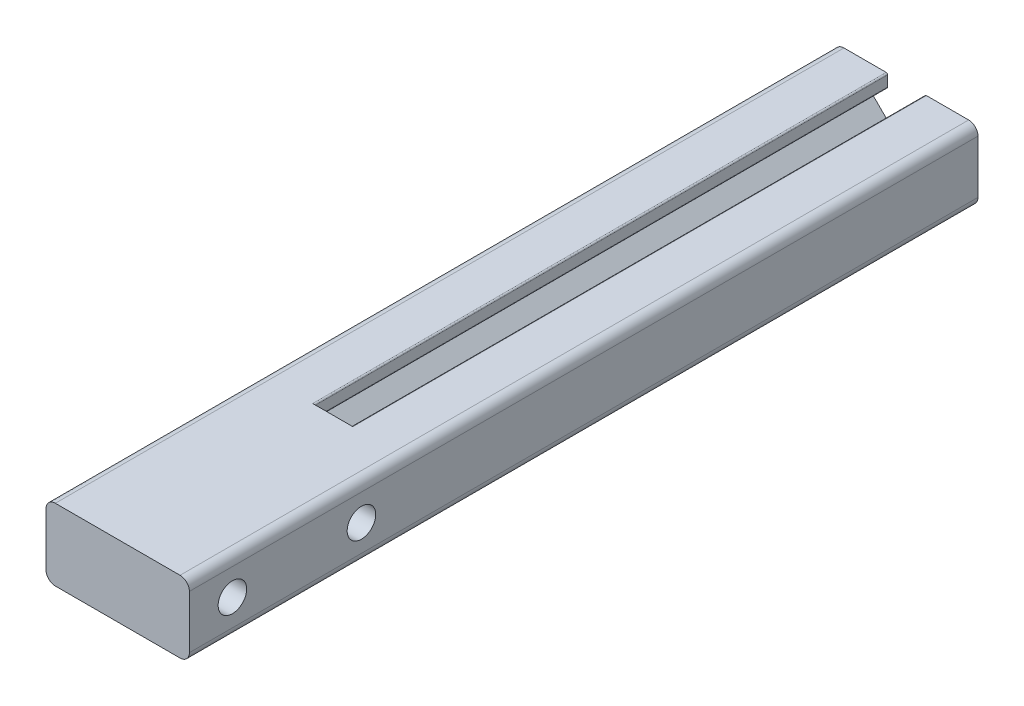
ISO-10303-21;
HEADER;
FILE_DESCRIPTION(('STEP AP214'),'2;1');
FILE_NAME('part.step','',(''),(''),'','','');
FILE_SCHEMA(('AUTOMOTIVE_DESIGN { 1 0 10303 214 1 1 1 1 }'));
ENDSEC;
DATA;
#1=APPLICATION_CONTEXT('core data for automotive mechanical design processes');
#2=APPLICATION_PROTOCOL_DEFINITION('international standard','automotive_design',2000,#1);
#3=PRODUCT_CONTEXT('',#1,'mechanical');
#4=PRODUCT('Part','Part','',(#3));
#5=PRODUCT_RELATED_PRODUCT_CATEGORY('part','',(#4));
#6=PRODUCT_DEFINITION_FORMATION('','',#4);
#7=PRODUCT_DEFINITION_CONTEXT('part definition',#1,'design');
#8=PRODUCT_DEFINITION('design','',#6,#7);
#9=PRODUCT_DEFINITION_SHAPE('','',#8);
#10=(LENGTH_UNIT() NAMED_UNIT(*) SI_UNIT(.MILLI.,.METRE.));
#11=(NAMED_UNIT(*) PLANE_ANGLE_UNIT() SI_UNIT($,.RADIAN.));
#12=(NAMED_UNIT(*) SI_UNIT($,.STERADIAN.) SOLID_ANGLE_UNIT());
#13=UNCERTAINTY_MEASURE_WITH_UNIT(LENGTH_MEASURE(1.E-05),#10,'distance_accuracy_value','');
#14=(GEOMETRIC_REPRESENTATION_CONTEXT(3) GLOBAL_UNCERTAINTY_ASSIGNED_CONTEXT((#13)) GLOBAL_UNIT_ASSIGNED_CONTEXT((#10,
#11,#12)) REPRESENTATION_CONTEXT('',''));
#15=CARTESIAN_POINT('',(0.,0.,0.));
#16=DIRECTION('',(0.,0.,1.));
#17=DIRECTION('',(1.,0.,0.));
#18=AXIS2_PLACEMENT_3D('',#15,#16,#17);
#19=CARTESIAN_POINT('',(-11.049,11.049,-50.8));
#20=DIRECTION('',(0.,0.,1.));
#21=DIRECTION('',(1.,0.,0.));
#22=AXIS2_PLACEMENT_3D('',#19,#20,#21);
#23=PLANE('',#22);
#24=DIRECTION('',(1.,0.,0.));
#25=VECTOR('',#24,1.);
#26=CARTESIAN_POINT('',(3.302,10.328863886556,-50.8));
#27=LINE('',#26,#25);
#28=CARTESIAN_POINT('',(3.556,10.328863886556,-50.8));
#29=VERTEX_POINT('',#28);
#30=CARTESIAN_POINT('',(6.985,10.328863886556,-50.8));
#31=VERTEX_POINT('',#30);
#32=EDGE_CURVE('E350',#29,#31,#27,.T.);
#33=ORIENTED_EDGE('',*,*,#32,.F.);
#34=CARTESIAN_POINT('',(3.556,10.582863886556,-50.8));
#35=DIRECTION('',(0.,0.,1.));
#36=DIRECTION('',(1.,0.,0.));
#37=AXIS2_PLACEMENT_3D('',#34,#35,#36);
#38=CIRCLE('',#37,0.254);
#39=CARTESIAN_POINT('',(3.302,10.582863886556,-50.8));
#40=VERTEX_POINT('',#39);
#41=EDGE_CURVE('E451',#29,#40,#38,.F.);
#42=ORIENTED_EDGE('',*,*,#41,.T.);
#43=DIRECTION('',(0.,-1.,0.));
#44=VECTOR('',#43,1.);
#45=CARTESIAN_POINT('',(3.302,12.7,-50.8));
#46=LINE('',#45,#44);
#47=CARTESIAN_POINT('',(3.302,12.446,-50.8));
#48=VERTEX_POINT('',#47);
#49=EDGE_CURVE('E346',#48,#40,#46,.T.);
#50=ORIENTED_EDGE('',*,*,#49,.F.);
#51=CARTESIAN_POINT('',(3.556,12.446,-50.8));
#52=DIRECTION('',(0.,0.,1.));
#53=DIRECTION('',(1.,0.,0.));
#54=AXIS2_PLACEMENT_3D('',#51,#52,#53);
#55=CIRCLE('',#54,0.254);
#56=CARTESIAN_POINT('',(3.556,12.7,-50.8));
#57=VERTEX_POINT('',#56);
#58=EDGE_CURVE('E448',#48,#57,#55,.F.);
#59=ORIENTED_EDGE('',*,*,#58,.T.);
#60=DIRECTION('',(-1.,0.,0.));
#61=VECTOR('',#60,1.);
#62=CARTESIAN_POINT('',(3.302,12.7,-50.8));
#63=LINE('',#62,#61);
#64=CARTESIAN_POINT('',(11.049,12.7,-50.8));
#65=VERTEX_POINT('',#64);
#66=EDGE_CURVE('E342',#65,#57,#63,.T.);
#67=ORIENTED_EDGE('',*,*,#66,.F.);
#68=CARTESIAN_POINT('',(11.049,11.049,-50.8));
#69=DIRECTION('',(0.,0.,1.));
#70=DIRECTION('',(1.,0.,0.));
#71=AXIS2_PLACEMENT_3D('',#68,#69,#70);
#72=CIRCLE('',#71,1.651);
#73=CARTESIAN_POINT('',(12.7,11.049,-50.8));
#74=VERTEX_POINT('',#73);
#75=EDGE_CURVE('E339',#74,#65,#72,.T.);
#76=ORIENTED_EDGE('',*,*,#75,.F.);
#77=DIRECTION('',(0.,1.,0.));
#78=VECTOR('',#77,1.);
#79=CARTESIAN_POINT('',(12.7,1.651,-50.8));
#80=LINE('',#79,#78);
#81=CARTESIAN_POINT('',(12.7,1.651,-50.8));
#82=VERTEX_POINT('',#81);
#83=EDGE_CURVE('E206',#82,#74,#80,.T.);
#84=ORIENTED_EDGE('',*,*,#83,.F.);
#85=CARTESIAN_POINT('',(11.049,1.651,-50.8));
#86=DIRECTION('',(0.,0.,1.));
#87=DIRECTION('',(1.,0.,0.));
#88=AXIS2_PLACEMENT_3D('',#85,#86,#87);
#89=CIRCLE('',#88,1.651);
#90=CARTESIAN_POINT('',(11.049,0.,-50.8));
#91=VERTEX_POINT('',#90);
#92=EDGE_CURVE('E334',#91,#82,#89,.T.);
#93=ORIENTED_EDGE('',*,*,#92,.F.);
#94=DIRECTION('',(1.,0.,0.));
#95=VECTOR('',#94,1.);
#96=CARTESIAN_POINT('',(11.049,0.,-50.8));
#97=LINE('',#96,#95);
#98=CARTESIAN_POINT('',(-11.049,0.,-50.8));
#99=VERTEX_POINT('',#98);
#100=EDGE_CURVE('E331',#99,#91,#97,.T.);
#101=ORIENTED_EDGE('',*,*,#100,.F.);
#102=CARTESIAN_POINT('',(-11.049,1.65099999999999,-50.8));
#103=DIRECTION('',(0.,0.,1.));
#104=DIRECTION('',(1.,0.,0.));
#105=AXIS2_PLACEMENT_3D('',#102,#103,#104);
#106=CIRCLE('',#105,1.651);
#107=CARTESIAN_POINT('',(-12.7,1.65099999999999,-50.8));
#108=VERTEX_POINT('',#107);
#109=EDGE_CURVE('E328',#108,#99,#106,.T.);
#110=ORIENTED_EDGE('',*,*,#109,.F.);
#111=DIRECTION('',(0.,-1.,0.));
#112=VECTOR('',#111,1.);
#113=CARTESIAN_POINT('',(-12.7,11.049,-50.8));
#114=LINE('',#113,#112);
#115=CARTESIAN_POINT('',(-12.7,11.049,-50.8));
#116=VERTEX_POINT('',#115);
#117=EDGE_CURVE('E325',#116,#108,#114,.T.);
#118=ORIENTED_EDGE('',*,*,#117,.F.);
#119=CARTESIAN_POINT('',(-11.049,11.049,-50.8));
#120=DIRECTION('',(0.,0.,1.));
#121=DIRECTION('',(1.,0.,0.));
#122=AXIS2_PLACEMENT_3D('',#119,#120,#121);
#123=CIRCLE('',#122,1.651);
#124=CARTESIAN_POINT('',(-11.049,12.7,-50.8));
#125=VERTEX_POINT('',#124);
#126=EDGE_CURVE('E275',#125,#116,#123,.T.);
#127=ORIENTED_EDGE('',*,*,#126,.F.);
#128=DIRECTION('',(-1.,0.,0.));
#129=VECTOR('',#128,1.);
#130=CARTESIAN_POINT('',(-11.049,12.7,-50.8));
#131=LINE('',#130,#129);
#132=CARTESIAN_POINT('',(-3.556,12.7,-50.8));
#133=VERTEX_POINT('',#132);
#134=EDGE_CURVE('E281',#133,#125,#131,.T.);
#135=ORIENTED_EDGE('',*,*,#134,.F.);
#136=CARTESIAN_POINT('',(-3.556,12.446,-50.8));
#137=DIRECTION('',(0.,0.,1.));
#138=DIRECTION('',(1.,0.,0.));
#139=AXIS2_PLACEMENT_3D('',#136,#137,#138);
#140=CIRCLE('',#139,0.254);
#141=CARTESIAN_POINT('',(-3.302,12.446,-50.8));
#142=VERTEX_POINT('',#141);
#143=EDGE_CURVE('E442',#133,#142,#140,.F.);
#144=ORIENTED_EDGE('',*,*,#143,.T.);
#145=DIRECTION('',(0.,1.,0.));
#146=VECTOR('',#145,1.);
#147=CARTESIAN_POINT('',(-3.302,12.7,-50.8));
#148=LINE('',#147,#146);
#149=CARTESIAN_POINT('',(-3.302,10.582863886556,-50.8));
#150=VERTEX_POINT('',#149);
#151=EDGE_CURVE('E378',#150,#142,#148,.T.);
#152=ORIENTED_EDGE('',*,*,#151,.F.);
#153=CARTESIAN_POINT('',(-3.556,10.582863886556,-50.8));
#154=DIRECTION('',(0.,0.,1.));
#155=DIRECTION('',(1.,0.,0.));
#156=AXIS2_PLACEMENT_3D('',#153,#154,#155);
#157=CIRCLE('',#156,0.254);
#158=CARTESIAN_POINT('',(-3.556,10.328863886556,-50.8));
#159=VERTEX_POINT('',#158);
#160=EDGE_CURVE('E445',#150,#159,#157,.F.);
#161=ORIENTED_EDGE('',*,*,#160,.T.);
#162=DIRECTION('',(1.,0.,0.));
#163=VECTOR('',#162,1.);
#164=CARTESIAN_POINT('',(-6.985,10.328863886556,-50.8));
#165=LINE('',#164,#163);
#166=CARTESIAN_POINT('',(-6.985,10.328863886556,-50.8));
#167=VERTEX_POINT('',#166);
#168=EDGE_CURVE('E374',#167,#159,#165,.T.);
#169=ORIENTED_EDGE('',*,*,#168,.F.);
#170=CARTESIAN_POINT('',(-6.985,9.82086388655604,-50.8));
#171=DIRECTION('',(0.,0.,-1.));
#172=DIRECTION('',(1.,0.,0.));
#173=AXIS2_PLACEMENT_3D('',#170,#171,#172);
#174=CIRCLE('',#173,0.507999999999999);
#175=CARTESIAN_POINT('',(-7.34421024484277,9.46165364171327,-50.8));
#176=VERTEX_POINT('',#175);
#177=EDGE_CURVE('E371',#176,#167,#174,.T.);
#178=ORIENTED_EDGE('',*,*,#177,.F.);
#179=DIRECTION('',(-0.707106781186546,0.707106781186549,0.));
#180=VECTOR('',#179,1.);
#181=CARTESIAN_POINT('',(-3.45250537891568,5.56994877578617,-50.8));
#182=LINE('',#181,#180);
#183=CARTESIAN_POINT('',(-3.45250537891568,5.56994877578617,-50.8));
#184=VERTEX_POINT('',#183);
#185=EDGE_CURVE('E368',#184,#176,#182,.T.);
#186=ORIENTED_EDGE('',*,*,#185,.F.);
#187=CARTESIAN_POINT('',(-1.65645415470184,7.366,-50.8));
#188=DIRECTION('',(0.,0.,-1.));
#189=DIRECTION('',(1.,0.,0.));
#190=AXIS2_PLACEMENT_3D('',#187,#188,#189);
#191=CIRCLE('',#190,2.54);
#192=CARTESIAN_POINT('',(-1.65645415470184,4.826,-50.8));
#193=VERTEX_POINT('',#192);
#194=EDGE_CURVE('E365',#193,#184,#191,.T.);
#195=ORIENTED_EDGE('',*,*,#194,.F.);
#196=DIRECTION('',(-1.,0.,0.));
#197=VECTOR('',#196,1.);
#198=CARTESIAN_POINT('',(1.65645415470184,4.826,-50.8));
#199=LINE('',#198,#197);
#200=CARTESIAN_POINT('',(1.65645415470184,4.826,-50.8));
#201=VERTEX_POINT('',#200);
#202=EDGE_CURVE('E362',#201,#193,#199,.T.);
#203=ORIENTED_EDGE('',*,*,#202,.F.);
#204=CARTESIAN_POINT('',(1.65645415470184,7.366,-50.8));
#205=DIRECTION('',(0.,0.,-1.));
#206=DIRECTION('',(1.,0.,0.));
#207=AXIS2_PLACEMENT_3D('',#204,#205,#206);
#208=CIRCLE('',#207,2.54);
#209=CARTESIAN_POINT('',(3.45250537891568,5.56994877578617,-50.8));
#210=VERTEX_POINT('',#209);
#211=EDGE_CURVE('E359',#210,#201,#208,.T.);
#212=ORIENTED_EDGE('',*,*,#211,.F.);
#213=DIRECTION('',(-0.707106781186546,-0.707106781186549,0.));
#214=VECTOR('',#213,1.);
#215=CARTESIAN_POINT('',(7.34421024484277,9.46165364171327,-50.8));
#216=LINE('',#215,#214);
#217=CARTESIAN_POINT('',(7.34421024484277,9.46165364171327,-50.8));
#218=VERTEX_POINT('',#217);
#219=EDGE_CURVE('E356',#218,#210,#216,.T.);
#220=ORIENTED_EDGE('',*,*,#219,.F.);
#221=CARTESIAN_POINT('',(6.985,9.82086388655604,-50.8));
#222=DIRECTION('',(0.,0.,-1.));
#223=DIRECTION('',(1.,0.,0.));
#224=AXIS2_PLACEMENT_3D('',#221,#222,#223);
#225=CIRCLE('',#224,0.508);
#226=EDGE_CURVE('E353',#31,#218,#225,.T.);
#227=ORIENTED_EDGE('',*,*,#226,.F.);
#228=EDGE_LOOP('',(#33,#42,#50,#59,#67,#76,#84,#93,#101,#110,#118,#127,#135,#144,#152,#161,#169,
#178,#186,#195,#203,#212,#220,#227));
#229=FACE_BOUND('',#228,.T.);
#230=CARTESIAN_POINT('',(8.509,4.064,-50.8));
#231=DIRECTION('',(0.,0.,1.));
#232=DIRECTION('',(1.,0.,0.));
#233=AXIS2_PLACEMENT_3D('',#230,#231,#232);
#234=CIRCLE('',#233,3.2385);
#235=CARTESIAN_POINT('',(11.7475,4.064,-50.8));
#236=VERTEX_POINT('',#235);
#237=EDGE_CURVE('E268',#236,#236,#234,.T.);
#238=ORIENTED_EDGE('',*,*,#237,.T.);
#239=EDGE_LOOP('',(#238));
#240=FACE_BOUND('',#239,.T.);
#241=CARTESIAN_POINT('',(-8.509,4.064,-50.8));
#242=DIRECTION('',(0.,0.,1.));
#243=DIRECTION('',(1.,0.,0.));
#244=AXIS2_PLACEMENT_3D('',#241,#242,#243);
#245=CIRCLE('',#244,3.2385);
#246=CARTESIAN_POINT('',(-5.2705,4.064,-50.8));
#247=VERTEX_POINT('',#246);
#248=EDGE_CURVE('E264',#247,#247,#245,.T.);
#249=ORIENTED_EDGE('',*,*,#248,.T.);
#250=EDGE_LOOP('',(#249));
#251=FACE_BOUND('',#250,.T.);
#252=ADVANCED_FACE('F39',(#229,#240,#251),#23,.F.);
#253=CARTESIAN_POINT('',(-11.049,11.049,50.8));
#254=DIRECTION('',(0.,0.,-1.));
#255=DIRECTION('',(-1.,0.,0.));
#256=AXIS2_PLACEMENT_3D('',#253,#254,#255);
#257=CYLINDRICAL_SURFACE('',#256,1.651);
#258=ORIENTED_EDGE('',*,*,#126,.T.);
#259=DIRECTION('',(0.,0.,-1.));
#260=VECTOR('',#259,1.);
#261=CARTESIAN_POINT('',(-12.7,11.049,50.8));
#262=LINE('',#261,#260);
#263=CARTESIAN_POINT('',(-12.7,11.049,88.9));
#264=VERTEX_POINT('',#263);
#265=EDGE_CURVE('E434',#264,#116,#262,.T.);
#266=ORIENTED_EDGE('',*,*,#265,.F.);
#267=CARTESIAN_POINT('',(-11.049,11.049,88.9));
#268=DIRECTION('',(0.,0.,-1.));
#269=DIRECTION('',(-1.,0.,0.));
#270=AXIS2_PLACEMENT_3D('',#267,#268,#269);
#271=CIRCLE('',#270,1.651);
#272=CARTESIAN_POINT('',(-11.049,12.7,88.9));
#273=VERTEX_POINT('',#272);
#274=EDGE_CURVE('E252',#264,#273,#271,.T.);
#275=ORIENTED_EDGE('',*,*,#274,.T.);
#276=DIRECTION('',(0.,0.,-1.));
#277=VECTOR('',#276,1.);
#278=CARTESIAN_POINT('',(-11.049,12.7,50.8));
#279=LINE('',#278,#277);
#280=EDGE_CURVE('E321',#273,#125,#279,.T.);
#281=ORIENTED_EDGE('',*,*,#280,.T.);
#282=EDGE_LOOP('',(#258,#266,#275,#281));
#283=FACE_BOUND('',#282,.T.);
#284=ADVANCED_FACE('F558',(#283),#257,.T.);
#285=CARTESIAN_POINT('',(-12.7,11.049,50.8));
#286=DIRECTION('',(1.,0.,0.));
#287=DIRECTION('',(0.,0.,-1.));
#288=AXIS2_PLACEMENT_3D('',#285,#286,#287);
#289=PLANE('',#288);
#290=CARTESIAN_POINT('',(-12.7,6.35,58.42));
#291=DIRECTION('',(1.,0.,0.));
#292=DIRECTION('',(0.,0.,-1.));
#293=AXIS2_PLACEMENT_3D('',#290,#291,#292);
#294=CIRCLE('',#293,2.52729999999998);
#295=CARTESIAN_POINT('',(-12.7,6.35,55.8927));
#296=VERTEX_POINT('',#295);
#297=EDGE_CURVE('E865',#296,#296,#294,.T.);
#298=ORIENTED_EDGE('',*,*,#297,.T.);
#299=EDGE_LOOP('',(#298));
#300=FACE_BOUND('',#299,.T.);
#301=CARTESIAN_POINT('',(-12.7,6.35,81.28));
#302=DIRECTION('',(1.,0.,0.));
#303=DIRECTION('',(0.,0.,-1.));
#304=AXIS2_PLACEMENT_3D('',#301,#302,#303);
#305=CIRCLE('',#304,2.52729999999998);
#306=CARTESIAN_POINT('',(-12.7,6.35,78.7527));
#307=VERTEX_POINT('',#306);
#308=EDGE_CURVE('E233',#307,#307,#305,.T.);
#309=ORIENTED_EDGE('',*,*,#308,.T.);
#310=EDGE_LOOP('',(#309));
#311=FACE_BOUND('',#310,.T.);
#312=ORIENTED_EDGE('',*,*,#117,.T.);
#313=DIRECTION('',(0.,0.,-1.));
#314=VECTOR('',#313,1.);
#315=CARTESIAN_POINT('',(-12.7,1.65099999999999,50.8));
#316=LINE('',#315,#314);
#317=CARTESIAN_POINT('',(-12.7,1.65099999999999,88.9));
#318=VERTEX_POINT('',#317);
#319=EDGE_CURVE('E430',#318,#108,#316,.T.);
#320=ORIENTED_EDGE('',*,*,#319,.F.);
#321=DIRECTION('',(0.,1.,0.));
#322=VECTOR('',#321,1.);
#323=CARTESIAN_POINT('',(-12.7,1.65099999999999,88.9));
#324=LINE('',#323,#322);
#325=EDGE_CURVE('E248',#318,#264,#324,.T.);
#326=ORIENTED_EDGE('',*,*,#325,.T.);
#327=ORIENTED_EDGE('',*,*,#265,.T.);
#328=EDGE_LOOP('',(#312,#320,#326,#327));
#329=FACE_BOUND('',#328,.T.);
#330=ADVANCED_FACE('F563',(#300,#311,#329),#289,.F.);
#331=CARTESIAN_POINT('',(-11.049,1.65099999999999,50.8));
#332=DIRECTION('',(0.,0.,-1.));
#333=DIRECTION('',(-1.,0.,0.));
#334=AXIS2_PLACEMENT_3D('',#331,#332,#333);
#335=CYLINDRICAL_SURFACE('',#334,1.651);
#336=ORIENTED_EDGE('',*,*,#109,.T.);
#337=DIRECTION('',(0.,0.,-1.));
#338=VECTOR('',#337,1.);
#339=CARTESIAN_POINT('',(-11.049,0.,50.8));
#340=LINE('',#339,#338);
#341=CARTESIAN_POINT('',(-11.049,0.,88.9));
#342=VERTEX_POINT('',#341);
#343=EDGE_CURVE('E426',#342,#99,#340,.T.);
#344=ORIENTED_EDGE('',*,*,#343,.F.);
#345=CARTESIAN_POINT('',(-11.049,1.65099999999999,88.9));
#346=DIRECTION('',(0.,0.,-1.));
#347=DIRECTION('',(-1.,0.,0.));
#348=AXIS2_PLACEMENT_3D('',#345,#346,#347);
#349=CIRCLE('',#348,1.651);
#350=EDGE_CURVE('E244',#342,#318,#349,.T.);
#351=ORIENTED_EDGE('',*,*,#350,.T.);
#352=ORIENTED_EDGE('',*,*,#319,.T.);
#353=EDGE_LOOP('',(#336,#344,#351,#352));
#354=FACE_BOUND('',#353,.T.);
#355=ADVANCED_FACE('F687',(#354),#335,.T.);
#356=CARTESIAN_POINT('',(11.049,0.,50.8));
#357=DIRECTION('',(0.,1.,0.));
#358=DIRECTION('',(-1.,0.,0.));
#359=AXIS2_PLACEMENT_3D('',#356,#357,#358);
#360=PLANE('',#359);
#361=ORIENTED_EDGE('',*,*,#100,.T.);
#362=DIRECTION('',(0.,0.,-1.));
#363=VECTOR('',#362,1.);
#364=CARTESIAN_POINT('',(11.049,0.,50.8));
#365=LINE('',#364,#363);
#366=CARTESIAN_POINT('',(11.049,0.,88.9));
#367=VERTEX_POINT('',#366);
#368=EDGE_CURVE('E422',#367,#91,#365,.T.);
#369=ORIENTED_EDGE('',*,*,#368,.F.);
#370=DIRECTION('',(-1.,0.,0.));
#371=VECTOR('',#370,1.);
#372=CARTESIAN_POINT('',(11.049,0.,88.9));
#373=LINE('',#372,#371);
#374=EDGE_CURVE('E240',#367,#342,#373,.T.);
#375=ORIENTED_EDGE('',*,*,#374,.T.);
#376=ORIENTED_EDGE('',*,*,#343,.T.);
#377=EDGE_LOOP('',(#361,#369,#375,#376));
#378=FACE_BOUND('',#377,.T.);
#379=ADVANCED_FACE('F702',(#378),#360,.F.);
#380=CARTESIAN_POINT('',(11.049,1.651,50.8));
#381=DIRECTION('',(0.,0.,-1.));
#382=DIRECTION('',(-1.,0.,0.));
#383=AXIS2_PLACEMENT_3D('',#380,#381,#382);
#384=CYLINDRICAL_SURFACE('',#383,1.651);
#385=ORIENTED_EDGE('',*,*,#92,.T.);
#386=DIRECTION('',(0.,0.,-1.));
#387=VECTOR('',#386,1.);
#388=CARTESIAN_POINT('',(12.7,1.651,50.8));
#389=LINE('',#388,#387);
#390=CARTESIAN_POINT('',(12.7,1.651,88.9));
#391=VERTEX_POINT('',#390);
#392=EDGE_CURVE('E211',#391,#82,#389,.T.);
#393=ORIENTED_EDGE('',*,*,#392,.F.);
#394=CARTESIAN_POINT('',(11.049,1.651,88.9));
#395=DIRECTION('',(0.,0.,-1.));
#396=DIRECTION('',(-1.,0.,0.));
#397=AXIS2_PLACEMENT_3D('',#394,#395,#396);
#398=CIRCLE('',#397,1.651);
#399=EDGE_CURVE('E222',#391,#367,#398,.T.);
#400=ORIENTED_EDGE('',*,*,#399,.T.);
#401=ORIENTED_EDGE('',*,*,#368,.T.);
#402=EDGE_LOOP('',(#385,#393,#400,#401));
#403=FACE_BOUND('',#402,.T.);
#404=ADVANCED_FACE('F673',(#403),#384,.T.);
#405=CARTESIAN_POINT('',(12.7,1.651,50.8));
#406=DIRECTION('',(-1.,0.,0.));
#407=DIRECTION('',(0.,0.,1.));
#408=AXIS2_PLACEMENT_3D('',#405,#406,#407);
#409=PLANE('',#408);
#410=CARTESIAN_POINT('',(12.7,6.35,58.42));
#411=DIRECTION('',(1.,0.,0.));
#412=DIRECTION('',(0.,0.,-1.));
#413=AXIS2_PLACEMENT_3D('',#410,#411,#412);
#414=CIRCLE('',#413,2.52729999999999);
#415=CARTESIAN_POINT('',(12.7,6.35,55.8927));
#416=VERTEX_POINT('',#415);
#417=EDGE_CURVE('E872',#416,#416,#414,.T.);
#418=ORIENTED_EDGE('',*,*,#417,.F.);
#419=EDGE_LOOP('',(#418));
#420=FACE_BOUND('',#419,.T.);
#421=CARTESIAN_POINT('',(12.7,6.35,81.28));
#422=DIRECTION('',(1.,0.,0.));
#423=DIRECTION('',(0.,0.,-1.));
#424=AXIS2_PLACEMENT_3D('',#421,#422,#423);
#425=CIRCLE('',#424,2.52729999999999);
#426=CARTESIAN_POINT('',(12.7,6.35,78.7527));
#427=VERTEX_POINT('',#426);
#428=EDGE_CURVE('E869',#427,#427,#425,.T.);
#429=ORIENTED_EDGE('',*,*,#428,.F.);
#430=EDGE_LOOP('',(#429));
#431=FACE_BOUND('',#430,.T.);
#432=ORIENTED_EDGE('',*,*,#83,.T.);
#433=DIRECTION('',(0.,0.,-1.));
#434=VECTOR('',#433,1.);
#435=CARTESIAN_POINT('',(12.7,11.049,50.8));
#436=LINE('',#435,#434);
#437=CARTESIAN_POINT('',(12.7,11.049,88.9));
#438=VERTEX_POINT('',#437);
#439=EDGE_CURVE('E200',#438,#74,#436,.T.);
#440=ORIENTED_EDGE('',*,*,#439,.F.);
#441=DIRECTION('',(0.,-1.,0.));
#442=VECTOR('',#441,1.);
#443=CARTESIAN_POINT('',(12.7,11.049,88.9));
#444=LINE('',#443,#442);
#445=EDGE_CURVE('E204',#438,#391,#444,.T.);
#446=ORIENTED_EDGE('',*,*,#445,.T.);
#447=ORIENTED_EDGE('',*,*,#392,.T.);
#448=EDGE_LOOP('',(#432,#440,#446,#447));
#449=FACE_BOUND('',#448,.T.);
#450=ADVANCED_FACE('F202',(#420,#431,#449),#409,.F.);
#451=CARTESIAN_POINT('',(11.049,11.049,50.8));
#452=DIRECTION('',(0.,0.,-1.));
#453=DIRECTION('',(-1.,0.,0.));
#454=AXIS2_PLACEMENT_3D('',#451,#452,#453);
#455=CYLINDRICAL_SURFACE('',#454,1.651);
#456=ORIENTED_EDGE('',*,*,#75,.T.);
#457=DIRECTION('',(0.,0.,-1.));
#458=VECTOR('',#457,1.);
#459=CARTESIAN_POINT('',(11.049,12.7,50.8));
#460=LINE('',#459,#458);
#461=CARTESIAN_POINT('',(11.049,12.7,88.9));
#462=VERTEX_POINT('',#461);
#463=EDGE_CURVE('E212',#462,#65,#460,.T.);
#464=ORIENTED_EDGE('',*,*,#463,.F.);
#465=CARTESIAN_POINT('',(11.049,11.049,88.9));
#466=DIRECTION('',(0.,0.,-1.));
#467=DIRECTION('',(-1.,0.,0.));
#468=AXIS2_PLACEMENT_3D('',#465,#466,#467);
#469=CIRCLE('',#468,1.651);
#470=EDGE_CURVE('E219',#462,#438,#469,.T.);
#471=ORIENTED_EDGE('',*,*,#470,.T.);
#472=ORIENTED_EDGE('',*,*,#439,.T.);
#473=EDGE_LOOP('',(#456,#464,#471,#472));
#474=FACE_BOUND('',#473,.T.);
#475=ADVANCED_FACE('F225',(#474),#455,.T.);
#476=CARTESIAN_POINT('',(3.302,12.7,50.8));
#477=DIRECTION('',(1.,0.,0.));
#478=DIRECTION('',(0.,1.,0.));
#479=AXIS2_PLACEMENT_3D('',#476,#477,#478);
#480=PLANE('',#479);
#481=ORIENTED_EDGE('',*,*,#49,.T.);
#482=DIRECTION('',(0.,0.,-1.));
#483=VECTOR('',#482,1.);
#484=CARTESIAN_POINT('',(3.302,10.582863886556,50.8));
#485=LINE('',#484,#483);
#486=CARTESIAN_POINT('',(3.302,10.582863886556,50.8));
#487=VERTEX_POINT('',#486);
#488=EDGE_CURVE('E458',#40,#487,#485,.F.);
#489=ORIENTED_EDGE('',*,*,#488,.T.);
#490=DIRECTION('',(0.,-1.,0.));
#491=VECTOR('',#490,1.);
#492=CARTESIAN_POINT('',(3.302,12.7,50.8));
#493=LINE('',#492,#491);
#494=CARTESIAN_POINT('',(3.302,12.446,50.8));
#495=VERTEX_POINT('',#494);
#496=EDGE_CURVE('E276',#495,#487,#493,.T.);
#497=ORIENTED_EDGE('',*,*,#496,.F.);
#498=DIRECTION('',(0.,0.,-1.));
#499=VECTOR('',#498,1.);
#500=CARTESIAN_POINT('',(3.302,12.446,50.8));
#501=LINE('',#500,#499);
#502=EDGE_CURVE('E454',#495,#48,#501,.T.);
#503=ORIENTED_EDGE('',*,*,#502,.T.);
#504=EDGE_LOOP('',(#481,#489,#497,#503));
#505=FACE_BOUND('',#504,.T.);
#506=ADVANCED_FACE('F519',(#505),#480,.F.);
#507=CARTESIAN_POINT('',(3.302,10.328863886556,50.8));
#508=DIRECTION('',(0.,1.,0.));
#509=DIRECTION('',(0.,0.,1.));
#510=AXIS2_PLACEMENT_3D('',#507,#508,#509);
#511=PLANE('',#510);
#512=DIRECTION('',(1.,0.,0.));
#513=VECTOR('',#512,1.);
#514=CARTESIAN_POINT('',(3.302,10.328863886556,50.8));
#515=LINE('',#514,#513);
#516=CARTESIAN_POINT('',(3.556,10.328863886556,50.8));
#517=VERTEX_POINT('',#516);
#518=CARTESIAN_POINT('',(6.985,10.328863886556,50.8));
#519=VERTEX_POINT('',#518);
#520=EDGE_CURVE('E280',#517,#519,#515,.T.);
#521=ORIENTED_EDGE('',*,*,#520,.F.);
#522=DIRECTION('',(0.,0.,-1.));
#523=VECTOR('',#522,1.);
#524=CARTESIAN_POINT('',(3.556,10.328863886556,50.8));
#525=LINE('',#524,#523);
#526=EDGE_CURVE('E438',#517,#29,#525,.T.);
#527=ORIENTED_EDGE('',*,*,#526,.T.);
#528=ORIENTED_EDGE('',*,*,#32,.T.);
#529=DIRECTION('',(0.,0.,-1.));
#530=VECTOR('',#529,1.);
#531=CARTESIAN_POINT('',(6.985,10.328863886556,50.8));
#532=LINE('',#531,#530);
#533=EDGE_CURVE('E414',#519,#31,#532,.T.);
#534=ORIENTED_EDGE('',*,*,#533,.F.);
#535=EDGE_LOOP('',(#521,#527,#528,#534));
#536=FACE_BOUND('',#535,.T.);
#537=ADVANCED_FACE('F526',(#536),#511,.F.);
#538=CARTESIAN_POINT('',(6.985,9.82086388655604,50.8));
#539=DIRECTION('',(0.,0.,-1.));
#540=DIRECTION('',(-1.,0.,0.));
#541=AXIS2_PLACEMENT_3D('',#538,#539,#540);
#542=CYLINDRICAL_SURFACE('',#541,0.508);
#543=ORIENTED_EDGE('',*,*,#226,.T.);
#544=DIRECTION('',(0.,0.,-1.));
#545=VECTOR('',#544,1.);
#546=CARTESIAN_POINT('',(7.34421024484277,9.46165364171327,50.8));
#547=LINE('',#546,#545);
#548=CARTESIAN_POINT('',(7.34421024484277,9.46165364171327,50.8));
#549=VERTEX_POINT('',#548);
#550=EDGE_CURVE('E410',#549,#218,#547,.T.);
#551=ORIENTED_EDGE('',*,*,#550,.F.);
#552=CARTESIAN_POINT('',(6.985,9.82086388655604,50.8));
#553=DIRECTION('',(0.,0.,-1.));
#554=DIRECTION('',(1.,0.,0.));
#555=AXIS2_PLACEMENT_3D('',#552,#553,#554);
#556=CIRCLE('',#555,0.508);
#557=EDGE_CURVE('E285',#519,#549,#556,.T.);
#558=ORIENTED_EDGE('',*,*,#557,.F.);
#559=ORIENTED_EDGE('',*,*,#533,.T.);
#560=EDGE_LOOP('',(#543,#551,#558,#559));
#561=FACE_BOUND('',#560,.T.);
#562=ADVANCED_FACE('F531',(#561),#542,.F.);
#563=CARTESIAN_POINT('',(7.34421024484277,9.46165364171327,50.8));
#564=DIRECTION('',(0.707106781186549,-0.707106781186546,0.));
#565=DIRECTION('',(0.707106781186546,0.707106781186549,0.));
#566=AXIS2_PLACEMENT_3D('',#563,#564,#565);
#567=PLANE('',#566);
#568=ORIENTED_EDGE('',*,*,#219,.T.);
#569=DIRECTION('',(0.,0.,-1.));
#570=VECTOR('',#569,1.);
#571=CARTESIAN_POINT('',(3.45250537891568,5.56994877578617,50.8));
#572=LINE('',#571,#570);
#573=CARTESIAN_POINT('',(3.45250537891568,5.56994877578617,50.8));
#574=VERTEX_POINT('',#573);
#575=EDGE_CURVE('E406',#574,#210,#572,.T.);
#576=ORIENTED_EDGE('',*,*,#575,.F.);
#577=DIRECTION('',(-0.707106781186546,-0.707106781186549,0.));
#578=VECTOR('',#577,1.);
#579=CARTESIAN_POINT('',(7.34421024484277,9.46165364171327,50.8));
#580=LINE('',#579,#578);
#581=EDGE_CURVE('E289',#549,#574,#580,.T.);
#582=ORIENTED_EDGE('',*,*,#581,.F.);
#583=ORIENTED_EDGE('',*,*,#550,.T.);
#584=EDGE_LOOP('',(#568,#576,#582,#583));
#585=FACE_BOUND('',#584,.T.);
#586=ADVANCED_FACE('F535',(#585),#567,.F.);
#587=CARTESIAN_POINT('',(1.65645415470184,7.366,50.8));
#588=DIRECTION('',(0.,0.,-1.));
#589=DIRECTION('',(-1.,0.,0.));
#590=AXIS2_PLACEMENT_3D('',#587,#588,#589);
#591=CYLINDRICAL_SURFACE('',#590,2.54);
#592=ORIENTED_EDGE('',*,*,#211,.T.);
#593=DIRECTION('',(0.,0.,-1.));
#594=VECTOR('',#593,1.);
#595=CARTESIAN_POINT('',(1.65645415470184,4.826,50.8));
#596=LINE('',#595,#594);
#597=CARTESIAN_POINT('',(1.65645415470184,4.826,50.8));
#598=VERTEX_POINT('',#597);
#599=EDGE_CURVE('E402',#598,#201,#596,.T.);
#600=ORIENTED_EDGE('',*,*,#599,.F.);
#601=CARTESIAN_POINT('',(1.65645415470184,7.366,50.8));
#602=DIRECTION('',(0.,0.,-1.));
#603=DIRECTION('',(1.,0.,0.));
#604=AXIS2_PLACEMENT_3D('',#601,#602,#603);
#605=CIRCLE('',#604,2.54);
#606=EDGE_CURVE('E293',#574,#598,#605,.T.);
#607=ORIENTED_EDGE('',*,*,#606,.F.);
#608=ORIENTED_EDGE('',*,*,#575,.T.);
#609=EDGE_LOOP('',(#592,#600,#607,#608));
#610=FACE_BOUND('',#609,.T.);
#611=ADVANCED_FACE('F539',(#610),#591,.F.);
#612=CARTESIAN_POINT('',(1.65645415470184,4.826,50.8));
#613=DIRECTION('',(0.,-1.,0.));
#614=DIRECTION('',(1.,0.,0.));
#615=AXIS2_PLACEMENT_3D('',#612,#613,#614);
#616=PLANE('',#615);
#617=ORIENTED_EDGE('',*,*,#202,.T.);
#618=DIRECTION('',(0.,0.,-1.));
#619=VECTOR('',#618,1.);
#620=CARTESIAN_POINT('',(-1.65645415470184,4.826,50.8));
#621=LINE('',#620,#619);
#622=CARTESIAN_POINT('',(-1.65645415470184,4.826,50.8));
#623=VERTEX_POINT('',#622);
#624=EDGE_CURVE('E398',#623,#193,#621,.T.);
#625=ORIENTED_EDGE('',*,*,#624,.F.);
#626=DIRECTION('',(-1.,0.,0.));
#627=VECTOR('',#626,1.);
#628=CARTESIAN_POINT('',(1.65645415470184,4.826,50.8));
#629=LINE('',#628,#627);
#630=EDGE_CURVE('E297',#598,#623,#629,.T.);
#631=ORIENTED_EDGE('',*,*,#630,.F.);
#632=ORIENTED_EDGE('',*,*,#599,.T.);
#633=EDGE_LOOP('',(#617,#625,#631,#632));
#634=FACE_BOUND('',#633,.T.);
#635=ADVANCED_FACE('F542',(#634),#616,.F.);
#636=CARTESIAN_POINT('',(-1.65645415470184,7.366,50.8));
#637=DIRECTION('',(0.,0.,-1.));
#638=DIRECTION('',(-1.,0.,0.));
#639=AXIS2_PLACEMENT_3D('',#636,#637,#638);
#640=CYLINDRICAL_SURFACE('',#639,2.54);
#641=ORIENTED_EDGE('',*,*,#194,.T.);
#642=DIRECTION('',(0.,0.,-1.));
#643=VECTOR('',#642,1.);
#644=CARTESIAN_POINT('',(-3.45250537891568,5.56994877578617,50.8));
#645=LINE('',#644,#643);
#646=CARTESIAN_POINT('',(-3.45250537891568,5.56994877578617,50.8));
#647=VERTEX_POINT('',#646);
#648=EDGE_CURVE('E394',#647,#184,#645,.T.);
#649=ORIENTED_EDGE('',*,*,#648,.F.);
#650=CARTESIAN_POINT('',(-1.65645415470184,7.366,50.8));
#651=DIRECTION('',(0.,0.,-1.));
#652=DIRECTION('',(1.,0.,0.));
#653=AXIS2_PLACEMENT_3D('',#650,#651,#652);
#654=CIRCLE('',#653,2.54);
#655=EDGE_CURVE('E301',#623,#647,#654,.T.);
#656=ORIENTED_EDGE('',*,*,#655,.F.);
#657=ORIENTED_EDGE('',*,*,#624,.T.);
#658=EDGE_LOOP('',(#641,#649,#656,#657));
#659=FACE_BOUND('',#658,.T.);
#660=ADVANCED_FACE('F546',(#659),#640,.F.);
#661=CARTESIAN_POINT('',(-3.45250537891568,5.56994877578617,50.8));
#662=DIRECTION('',(-0.707106781186549,-0.707106781186546,0.));
#663=DIRECTION('',(0.707106781186546,-0.707106781186549,0.));
#664=AXIS2_PLACEMENT_3D('',#661,#662,#663);
#665=PLANE('',#664);
#666=ORIENTED_EDGE('',*,*,#185,.T.);
#667=DIRECTION('',(0.,0.,-1.));
#668=VECTOR('',#667,1.);
#669=CARTESIAN_POINT('',(-7.34421024484277,9.46165364171327,50.8));
#670=LINE('',#669,#668);
#671=CARTESIAN_POINT('',(-7.34421024484277,9.46165364171327,50.8));
#672=VERTEX_POINT('',#671);
#673=EDGE_CURVE('E390',#672,#176,#670,.T.);
#674=ORIENTED_EDGE('',*,*,#673,.F.);
#675=DIRECTION('',(-0.707106781186546,0.707106781186549,0.));
#676=VECTOR('',#675,1.);
#677=CARTESIAN_POINT('',(-3.45250537891568,5.56994877578617,50.8));
#678=LINE('',#677,#676);
#679=EDGE_CURVE('E305',#647,#672,#678,.T.);
#680=ORIENTED_EDGE('',*,*,#679,.F.);
#681=ORIENTED_EDGE('',*,*,#648,.T.);
#682=EDGE_LOOP('',(#666,#674,#680,#681));
#683=FACE_BOUND('',#682,.T.);
#684=ADVANCED_FACE('F548',(#683),#665,.F.);
#685=CARTESIAN_POINT('',(-6.985,9.82086388655604,50.8));
#686=DIRECTION('',(0.,0.,-1.));
#687=DIRECTION('',(-1.,0.,0.));
#688=AXIS2_PLACEMENT_3D('',#685,#686,#687);
#689=CYLINDRICAL_SURFACE('',#688,0.507999999999999);
#690=ORIENTED_EDGE('',*,*,#177,.T.);
#691=DIRECTION('',(0.,0.,-1.));
#692=VECTOR('',#691,1.);
#693=CARTESIAN_POINT('',(-6.985,10.328863886556,50.8));
#694=LINE('',#693,#692);
#695=CARTESIAN_POINT('',(-6.985,10.328863886556,50.8));
#696=VERTEX_POINT('',#695);
#697=EDGE_CURVE('E386',#696,#167,#694,.T.);
#698=ORIENTED_EDGE('',*,*,#697,.F.);
#699=CARTESIAN_POINT('',(-6.985,9.82086388655604,50.8));
#700=DIRECTION('',(0.,0.,-1.));
#701=DIRECTION('',(1.,0.,0.));
#702=AXIS2_PLACEMENT_3D('',#699,#700,#701);
#703=CIRCLE('',#702,0.507999999999999);
#704=EDGE_CURVE('E309',#672,#696,#703,.T.);
#705=ORIENTED_EDGE('',*,*,#704,.F.);
#706=ORIENTED_EDGE('',*,*,#673,.T.);
#707=EDGE_LOOP('',(#690,#698,#705,#706));
#708=FACE_BOUND('',#707,.T.);
#709=ADVANCED_FACE('F499',(#708),#689,.F.);
#710=CARTESIAN_POINT('',(-6.985,10.328863886556,50.8));
#711=DIRECTION('',(0.,1.,0.));
#712=DIRECTION('',(-1.,0.,0.));
#713=AXIS2_PLACEMENT_3D('',#710,#711,#712);
#714=PLANE('',#713);
#715=ORIENTED_EDGE('',*,*,#168,.T.);
#716=DIRECTION('',(0.,0.,-1.));
#717=VECTOR('',#716,1.);
#718=CARTESIAN_POINT('',(-3.556,10.328863886556,50.8));
#719=LINE('',#718,#717);
#720=CARTESIAN_POINT('',(-3.556,10.328863886556,50.8));
#721=VERTEX_POINT('',#720);
#722=EDGE_CURVE('E48',#159,#721,#719,.F.);
#723=ORIENTED_EDGE('',*,*,#722,.T.);
#724=DIRECTION('',(1.,0.,0.));
#725=VECTOR('',#724,1.);
#726=CARTESIAN_POINT('',(-6.985,10.328863886556,50.8));
#727=LINE('',#726,#725);
#728=EDGE_CURVE('E313',#696,#721,#727,.T.);
#729=ORIENTED_EDGE('',*,*,#728,.F.);
#730=ORIENTED_EDGE('',*,*,#697,.T.);
#731=EDGE_LOOP('',(#715,#723,#729,#730));
#732=FACE_BOUND('',#731,.T.);
#733=ADVANCED_FACE('F489',(#732),#714,.F.);
#734=CARTESIAN_POINT('',(-3.302,12.7,50.8));
#735=DIRECTION('',(-1.,0.,0.));
#736=DIRECTION('',(0.,-1.,0.));
#737=AXIS2_PLACEMENT_3D('',#734,#735,#736);
#738=PLANE('',#737);
#739=DIRECTION('',(0.,1.,0.));
#740=VECTOR('',#739,1.);
#741=CARTESIAN_POINT('',(-3.302,12.7,50.8));
#742=LINE('',#741,#740);
#743=CARTESIAN_POINT('',(-3.302,10.582863886556,50.8));
#744=VERTEX_POINT('',#743);
#745=CARTESIAN_POINT('',(-3.302,12.446,50.8));
#746=VERTEX_POINT('',#745);
#747=EDGE_CURVE('E317',#744,#746,#742,.T.);
#748=ORIENTED_EDGE('',*,*,#747,.F.);
#749=DIRECTION('',(0.,0.,-1.));
#750=VECTOR('',#749,1.);
#751=CARTESIAN_POINT('',(-3.302,10.582863886556,50.8));
#752=LINE('',#751,#750);
#753=EDGE_CURVE('E481',#744,#150,#752,.T.);
#754=ORIENTED_EDGE('',*,*,#753,.T.);
#755=ORIENTED_EDGE('',*,*,#151,.T.);
#756=DIRECTION('',(0.,0.,-1.));
#757=VECTOR('',#756,1.);
#758=CARTESIAN_POINT('',(-3.302,12.446,50.8));
#759=LINE('',#758,#757);
#760=EDGE_CURVE('E61',#142,#746,#759,.F.);
#761=ORIENTED_EDGE('',*,*,#760,.T.);
#762=EDGE_LOOP('',(#748,#754,#755,#761));
#763=FACE_BOUND('',#762,.T.);
#764=ADVANCED_FACE('F506',(#763),#738,.F.);
#765=CARTESIAN_POINT('',(-11.049,12.7,50.8));
#766=DIRECTION('',(0.,-1.,0.));
#767=DIRECTION('',(1.,0.,0.));
#768=AXIS2_PLACEMENT_3D('',#765,#766,#767);
#769=PLANE('',#768);
#770=ORIENTED_EDGE('',*,*,#280,.F.);
#771=DIRECTION('',(1.,0.,0.));
#772=VECTOR('',#771,1.);
#773=CARTESIAN_POINT('',(-11.049,12.7,88.9));
#774=LINE('',#773,#772);
#775=EDGE_CURVE('E256',#273,#462,#774,.T.);
#776=ORIENTED_EDGE('',*,*,#775,.T.);
#777=ORIENTED_EDGE('',*,*,#463,.T.);
#778=ORIENTED_EDGE('',*,*,#66,.T.);
#779=DIRECTION('',(0.,0.,-1.));
#780=VECTOR('',#779,1.);
#781=CARTESIAN_POINT('',(3.556,12.7,50.8));
#782=LINE('',#781,#780);
#783=CARTESIAN_POINT('',(3.556,12.7,50.8));
#784=VERTEX_POINT('',#783);
#785=EDGE_CURVE('E476',#57,#784,#782,.F.);
#786=ORIENTED_EDGE('',*,*,#785,.T.);
#787=DIRECTION('',(1.,0.,0.));
#788=VECTOR('',#787,1.);
#789=CARTESIAN_POINT('',(-3.556,12.7,50.8));
#790=LINE('',#789,#788);
#791=CARTESIAN_POINT('',(-3.556,12.7,50.8));
#792=VERTEX_POINT('',#791);
#793=EDGE_CURVE('E229',#792,#784,#790,.T.);
#794=ORIENTED_EDGE('',*,*,#793,.F.);
#795=DIRECTION('',(0.,0.,-1.));
#796=VECTOR('',#795,1.);
#797=CARTESIAN_POINT('',(-3.556,12.7,50.8));
#798=LINE('',#797,#796);
#799=EDGE_CURVE('E11',#792,#133,#798,.T.);
#800=ORIENTED_EDGE('',*,*,#799,.T.);
#801=ORIENTED_EDGE('',*,*,#134,.T.);
#802=EDGE_LOOP('',(#770,#776,#777,#778,#786,#794,#800,#801));
#803=FACE_BOUND('',#802,.T.);
#804=ADVANCED_FACE('F509',(#803),#769,.F.);
#805=CARTESIAN_POINT('',(8.509,4.064,50.8));
#806=DIRECTION('',(0.,0.,-1.));
#807=DIRECTION('',(-1.,0.,0.));
#808=AXIS2_PLACEMENT_3D('',#805,#806,#807);
#809=CYLINDRICAL_SURFACE('',#808,3.2385);
#810=CARTESIAN_POINT('',(8.509,4.064,50.8));
#811=DIRECTION('',(0.,0.,1.));
#812=DIRECTION('',(1.,0.,0.));
#813=AXIS2_PLACEMENT_3D('',#810,#811,#812);
#814=CIRCLE('',#813,3.2385);
#815=CARTESIAN_POINT('',(11.7475,4.064,50.8));
#816=VERTEX_POINT('',#815);
#817=EDGE_CURVE('E263',#816,#816,#814,.T.);
#818=ORIENTED_EDGE('',*,*,#817,.T.);
#819=EDGE_LOOP('',(#818));
#820=FACE_BOUND('',#819,.T.);
#821=ORIENTED_EDGE('',*,*,#237,.F.);
#822=EDGE_LOOP('',(#821));
#823=FACE_BOUND('',#822,.T.);
#824=ADVANCED_FACE('F568',(#820,#823),#809,.F.);
#825=CARTESIAN_POINT('',(-8.509,4.064,50.8));
#826=DIRECTION('',(0.,0.,-1.));
#827=DIRECTION('',(-1.,0.,0.));
#828=AXIS2_PLACEMENT_3D('',#825,#826,#827);
#829=CYLINDRICAL_SURFACE('',#828,3.2385);
#830=CARTESIAN_POINT('',(-8.509,4.064,50.8));
#831=DIRECTION('',(0.,0.,1.));
#832=DIRECTION('',(1.,0.,0.));
#833=AXIS2_PLACEMENT_3D('',#830,#831,#832);
#834=CIRCLE('',#833,3.2385);
#835=CARTESIAN_POINT('',(-5.2705,4.064,50.8));
#836=VERTEX_POINT('',#835);
#837=EDGE_CURVE('E258',#836,#836,#834,.T.);
#838=ORIENTED_EDGE('',*,*,#837,.T.);
#839=EDGE_LOOP('',(#838));
#840=FACE_BOUND('',#839,.T.);
#841=ORIENTED_EDGE('',*,*,#248,.F.);
#842=EDGE_LOOP('',(#841));
#843=FACE_BOUND('',#842,.T.);
#844=ADVANCED_FACE('F594',(#840,#843),#829,.F.);
#845=CARTESIAN_POINT('',(3.556,10.582863886556,50.8));
#846=DIRECTION('',(0.,0.,-1.));
#847=DIRECTION('',(-1.,0.,0.));
#848=AXIS2_PLACEMENT_3D('',#845,#846,#847);
#849=CYLINDRICAL_SURFACE('',#848,0.254);
#850=CARTESIAN_POINT('',(3.556,10.582863886556,50.8));
#851=DIRECTION('',(0.,0.,1.));
#852=DIRECTION('',(1.,0.,0.));
#853=AXIS2_PLACEMENT_3D('',#850,#851,#852);
#854=CIRCLE('',#853,0.254);
#855=EDGE_CURVE('E472',#487,#517,#854,.T.);
#856=ORIENTED_EDGE('',*,*,#855,.F.);
#857=ORIENTED_EDGE('',*,*,#488,.F.);
#858=ORIENTED_EDGE('',*,*,#41,.F.);
#859=ORIENTED_EDGE('',*,*,#526,.F.);
#860=EDGE_LOOP('',(#856,#857,#858,#859));
#861=FACE_BOUND('',#860,.T.);
#862=ADVANCED_FACE('F524',(#861),#849,.T.);
#863=CARTESIAN_POINT('',(3.556,12.446,50.8));
#864=DIRECTION('',(0.,0.,-1.));
#865=DIRECTION('',(-1.,0.,0.));
#866=AXIS2_PLACEMENT_3D('',#863,#864,#865);
#867=CYLINDRICAL_SURFACE('',#866,0.254);
#868=CARTESIAN_POINT('',(3.556,12.446,50.8));
#869=DIRECTION('',(0.,0.,1.));
#870=DIRECTION('',(1.,0.,0.));
#871=AXIS2_PLACEMENT_3D('',#868,#869,#870);
#872=CIRCLE('',#871,0.254);
#873=EDGE_CURVE('E468',#784,#495,#872,.T.);
#874=ORIENTED_EDGE('',*,*,#873,.F.);
#875=ORIENTED_EDGE('',*,*,#785,.F.);
#876=ORIENTED_EDGE('',*,*,#58,.F.);
#877=ORIENTED_EDGE('',*,*,#502,.F.);
#878=EDGE_LOOP('',(#874,#875,#876,#877));
#879=FACE_BOUND('',#878,.T.);
#880=ADVANCED_FACE('F515',(#879),#867,.T.);
#881=CARTESIAN_POINT('',(-3.556,10.582863886556,50.8));
#882=DIRECTION('',(0.,0.,-1.));
#883=DIRECTION('',(-1.,0.,0.));
#884=AXIS2_PLACEMENT_3D('',#881,#882,#883);
#885=CYLINDRICAL_SURFACE('',#884,0.254);
#886=CARTESIAN_POINT('',(-3.556,10.582863886556,50.8));
#887=DIRECTION('',(0.,0.,1.));
#888=DIRECTION('',(1.,0.,0.));
#889=AXIS2_PLACEMENT_3D('',#886,#887,#888);
#890=CIRCLE('',#889,0.254);
#891=EDGE_CURVE('E464',#721,#744,#890,.T.);
#892=ORIENTED_EDGE('',*,*,#891,.F.);
#893=ORIENTED_EDGE('',*,*,#722,.F.);
#894=ORIENTED_EDGE('',*,*,#160,.F.);
#895=ORIENTED_EDGE('',*,*,#753,.F.);
#896=EDGE_LOOP('',(#892,#893,#894,#895));
#897=FACE_BOUND('',#896,.T.);
#898=ADVANCED_FACE('F493',(#897),#885,.T.);
#899=CARTESIAN_POINT('',(-3.556,12.446,50.8));
#900=DIRECTION('',(0.,0.,-1.));
#901=DIRECTION('',(-1.,0.,0.));
#902=AXIS2_PLACEMENT_3D('',#899,#900,#901);
#903=CYLINDRICAL_SURFACE('',#902,0.254);
#904=CARTESIAN_POINT('',(-3.556,12.446,50.8));
#905=DIRECTION('',(0.,0.,1.));
#906=DIRECTION('',(1.,0.,0.));
#907=AXIS2_PLACEMENT_3D('',#904,#905,#906);
#908=CIRCLE('',#907,0.254);
#909=EDGE_CURVE('E461',#746,#792,#908,.T.);
#910=ORIENTED_EDGE('',*,*,#909,.F.);
#911=ORIENTED_EDGE('',*,*,#760,.F.);
#912=ORIENTED_EDGE('',*,*,#143,.F.);
#913=ORIENTED_EDGE('',*,*,#799,.F.);
#914=EDGE_LOOP('',(#910,#911,#912,#913));
#915=FACE_BOUND('',#914,.T.);
#916=ADVANCED_FACE('F41',(#915),#903,.T.);
#917=CARTESIAN_POINT('',(11.049,11.049,50.8));
#918=DIRECTION('',(0.,0.,-1.));
#919=DIRECTION('',(-1.,0.,0.));
#920=AXIS2_PLACEMENT_3D('',#917,#918,#919);
#921=PLANE('',#920);
#922=ORIENTED_EDGE('',*,*,#837,.F.);
#923=EDGE_LOOP('',(#922));
#924=FACE_BOUND('',#923,.T.);
#925=ADVANCED_FACE('F623',(#924),#921,.T.);
#926=ORIENTED_EDGE('',*,*,#747,.T.);
#927=ORIENTED_EDGE('',*,*,#909,.T.);
#928=ORIENTED_EDGE('',*,*,#793,.T.);
#929=ORIENTED_EDGE('',*,*,#873,.T.);
#930=ORIENTED_EDGE('',*,*,#496,.T.);
#931=ORIENTED_EDGE('',*,*,#855,.T.);
#932=ORIENTED_EDGE('',*,*,#520,.T.);
#933=ORIENTED_EDGE('',*,*,#557,.T.);
#934=ORIENTED_EDGE('',*,*,#581,.T.);
#935=ORIENTED_EDGE('',*,*,#606,.T.);
#936=ORIENTED_EDGE('',*,*,#630,.T.);
#937=ORIENTED_EDGE('',*,*,#655,.T.);
#938=ORIENTED_EDGE('',*,*,#679,.T.);
#939=ORIENTED_EDGE('',*,*,#704,.T.);
#940=ORIENTED_EDGE('',*,*,#728,.T.);
#941=ORIENTED_EDGE('',*,*,#891,.T.);
#942=EDGE_LOOP('',(#926,#927,#928,#929,#930,#931,#932,#933,#934,#935,#936,#937,#938,#939,#940,#941));
#943=FACE_BOUND('',#942,.T.);
#944=ADVANCED_FACE('F495',(#943),#921,.T.);
#945=CARTESIAN_POINT('',(11.049,11.049,88.9));
#946=DIRECTION('',(0.,0.,-1.));
#947=DIRECTION('',(-1.,0.,0.));
#948=AXIS2_PLACEMENT_3D('',#945,#946,#947);
#949=PLANE('',#948);
#950=ORIENTED_EDGE('',*,*,#470,.F.);
#951=ORIENTED_EDGE('',*,*,#775,.F.);
#952=ORIENTED_EDGE('',*,*,#274,.F.);
#953=ORIENTED_EDGE('',*,*,#325,.F.);
#954=ORIENTED_EDGE('',*,*,#350,.F.);
#955=ORIENTED_EDGE('',*,*,#374,.F.);
#956=ORIENTED_EDGE('',*,*,#399,.F.);
#957=ORIENTED_EDGE('',*,*,#445,.F.);
#958=EDGE_LOOP('',(#950,#951,#952,#953,#954,#955,#956,#957));
#959=FACE_BOUND('',#958,.T.);
#960=ADVANCED_FACE('F217',(#959),#949,.F.);
#961=ORIENTED_EDGE('',*,*,#817,.F.);
#962=EDGE_LOOP('',(#961));
#963=FACE_BOUND('',#962,.T.);
#964=ADVANCED_FACE('F631',(#963),#921,.T.);
#965=CARTESIAN_POINT('',(12.7,6.35,81.28));
#966=DIRECTION('',(1.,0.,0.));
#967=DIRECTION('',(0.,0.,-1.));
#968=AXIS2_PLACEMENT_3D('',#965,#966,#967);
#969=CYLINDRICAL_SURFACE('',#968,2.52729999999999);
#970=ORIENTED_EDGE('',*,*,#308,.F.);
#971=EDGE_LOOP('',(#970));
#972=FACE_BOUND('',#971,.T.);
#973=ORIENTED_EDGE('',*,*,#428,.T.);
#974=EDGE_LOOP('',(#973));
#975=FACE_BOUND('',#974,.T.);
#976=ADVANCED_FACE('F648',(#972,#975),#969,.F.);
#977=CARTESIAN_POINT('',(12.7,6.35,58.42));
#978=DIRECTION('',(1.,0.,0.));
#979=DIRECTION('',(0.,0.,-1.));
#980=AXIS2_PLACEMENT_3D('',#977,#978,#979);
#981=CYLINDRICAL_SURFACE('',#980,2.52729999999999);
#982=ORIENTED_EDGE('',*,*,#297,.F.);
#983=EDGE_LOOP('',(#982));
#984=FACE_BOUND('',#983,.T.);
#985=ORIENTED_EDGE('',*,*,#417,.T.);
#986=EDGE_LOOP('',(#985));
#987=FACE_BOUND('',#986,.T.);
#988=ADVANCED_FACE('F655',(#984,#987),#981,.F.);
#989=CLOSED_SHELL('',(#252,#284,#330,#355,#379,#404,#450,#475,#506,#537,#562,#586,#611,#635,
#660,#684,#709,#733,#764,#804,#824,#844,#862,#880,#898,#916,#925,#944,#960,#964,#976,#988));
#990=MANIFOLD_SOLID_BREP('B2',#989);
#991=ADVANCED_BREP_SHAPE_REPRESENTATION('',(#18,#990),#14);
#992=SHAPE_DEFINITION_REPRESENTATION(#9,#991);
ENDSEC;
END-ISO-10303-21;
